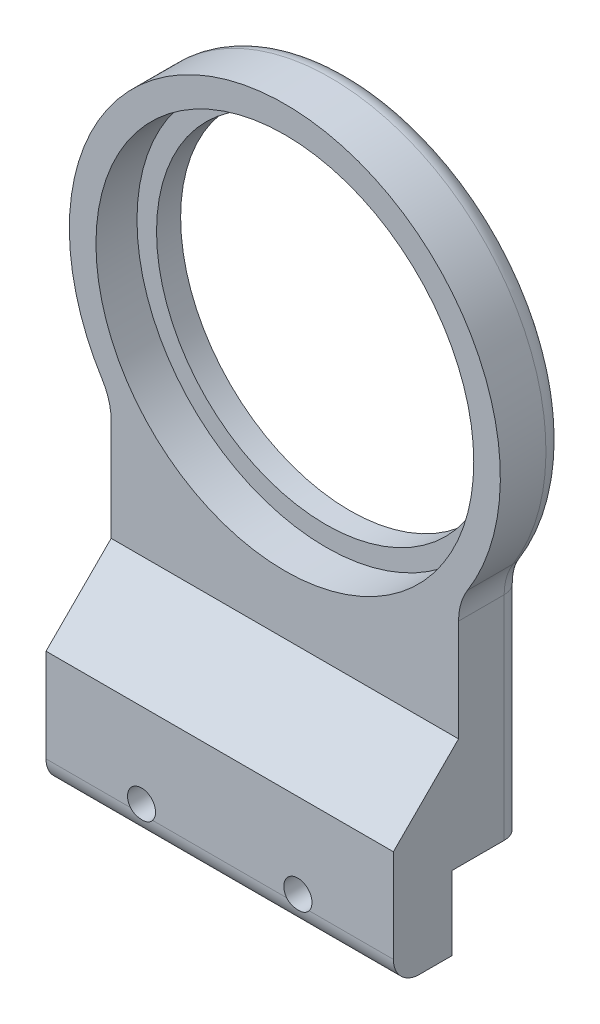
ISO-10303-21;
HEADER;
FILE_DESCRIPTION(('STEP AP214'),'2;1');
FILE_NAME('part.step','',(''),(''),'','','');
FILE_SCHEMA(('AUTOMOTIVE_DESIGN { 1 0 10303 214 1 1 1 1 }'));
ENDSEC;
DATA;
#1=APPLICATION_CONTEXT('core data for automotive mechanical design processes');
#2=APPLICATION_PROTOCOL_DEFINITION('international standard','automotive_design',2000,#1);
#3=PRODUCT_CONTEXT('',#1,'mechanical');
#4=PRODUCT('Part','Part','',(#3));
#5=PRODUCT_RELATED_PRODUCT_CATEGORY('part','',(#4));
#6=PRODUCT_DEFINITION_FORMATION('','',#4);
#7=PRODUCT_DEFINITION_CONTEXT('part definition',#1,'design');
#8=PRODUCT_DEFINITION('design','',#6,#7);
#9=PRODUCT_DEFINITION_SHAPE('','',#8);
#10=(LENGTH_UNIT() NAMED_UNIT(*) SI_UNIT(.MILLI.,.METRE.));
#11=(NAMED_UNIT(*) PLANE_ANGLE_UNIT() SI_UNIT($,.RADIAN.));
#12=(NAMED_UNIT(*) SI_UNIT($,.STERADIAN.) SOLID_ANGLE_UNIT());
#13=UNCERTAINTY_MEASURE_WITH_UNIT(LENGTH_MEASURE(1.E-05),#10,'distance_accuracy_value','');
#14=(GEOMETRIC_REPRESENTATION_CONTEXT(3) GLOBAL_UNCERTAINTY_ASSIGNED_CONTEXT((#13)) GLOBAL_UNIT_ASSIGNED_CONTEXT((#10,
#11,#12)) REPRESENTATION_CONTEXT('',''));
#15=CARTESIAN_POINT('',(0.,0.,0.));
#16=DIRECTION('',(0.,0.,1.));
#17=DIRECTION('',(1.,0.,0.));
#18=AXIS2_PLACEMENT_3D('',#15,#16,#17);
#19=CARTESIAN_POINT('',(-12.,-33.8419962523752,22.));
#20=DIRECTION('',(0.,0.,-1.));
#21=DIRECTION('',(-1.,0.,0.));
#22=AXIS2_PLACEMENT_3D('',#19,#20,#21);
#23=CYLINDRICAL_SURFACE('',#22,1.7);
#24=CARTESIAN_POINT('',(-12.,-33.8419962523752,14.));
#25=DIRECTION('',(0.,0.,1.));
#26=DIRECTION('',(1.,0.,0.));
#27=AXIS2_PLACEMENT_3D('',#24,#25,#26);
#28=CIRCLE('',#27,1.7);
#29=CARTESIAN_POINT('',(-10.3,-33.8419962523752,14.));
#30=VERTEX_POINT('',#29);
#31=EDGE_CURVE('E265',#30,#30,#28,.F.);
#32=ORIENTED_EDGE('',*,*,#31,.F.);
#33=EDGE_LOOP('',(#32));
#34=FACE_BOUND('',#33,.T.);
#35=CARTESIAN_POINT('',(-12.,-33.8419962523752,11.));
#36=DIRECTION('',(0.,0.,-1.));
#37=DIRECTION('',(-1.,0.,0.));
#38=AXIS2_PLACEMENT_3D('',#35,#36,#37);
#39=CIRCLE('',#38,1.7);
#40=CARTESIAN_POINT('',(-13.7,-33.8419962523752,11.));
#41=VERTEX_POINT('',#40);
#42=EDGE_CURVE('E442',#41,#41,#39,.F.);
#43=ORIENTED_EDGE('',*,*,#42,.F.);
#44=EDGE_LOOP('',(#43));
#45=FACE_BOUND('',#44,.T.);
#46=ADVANCED_FACE('F44',(#34,#45),#23,.F.);
#47=CARTESIAN_POINT('',(12.,-33.8419962523752,22.));
#48=DIRECTION('',(0.,0.,-1.));
#49=DIRECTION('',(-1.,0.,0.));
#50=AXIS2_PLACEMENT_3D('',#47,#48,#49);
#51=CYLINDRICAL_SURFACE('',#50,1.7);
#52=CARTESIAN_POINT('',(12.,-33.8419962523752,14.));
#53=DIRECTION('',(0.,0.,1.));
#54=DIRECTION('',(1.,0.,0.));
#55=AXIS2_PLACEMENT_3D('',#52,#53,#54);
#56=CIRCLE('',#55,1.7);
#57=CARTESIAN_POINT('',(13.7,-33.8419962523752,14.));
#58=VERTEX_POINT('',#57);
#59=EDGE_CURVE('E275',#58,#58,#56,.F.);
#60=ORIENTED_EDGE('',*,*,#59,.F.);
#61=EDGE_LOOP('',(#60));
#62=FACE_BOUND('',#61,.T.);
#63=CARTESIAN_POINT('',(12.,-33.8419962523752,11.));
#64=DIRECTION('',(0.,0.,-1.));
#65=DIRECTION('',(-1.,0.,0.));
#66=AXIS2_PLACEMENT_3D('',#63,#64,#65);
#67=CIRCLE('',#66,1.7);
#68=CARTESIAN_POINT('',(10.3,-33.8419962523752,11.));
#69=VERTEX_POINT('',#68);
#70=EDGE_CURVE('E449',#69,#69,#67,.F.);
#71=ORIENTED_EDGE('',*,*,#70,.F.);
#72=EDGE_LOOP('',(#71));
#73=FACE_BOUND('',#72,.T.);
#74=ADVANCED_FACE('F318',(#62,#73),#51,.F.);
#75=CARTESIAN_POINT('',(26.6642218613044,-39.1580037476248,8.));
#76=DIRECTION('',(0.,1.,0.));
#77=DIRECTION('',(0.,0.,1.));
#78=AXIS2_PLACEMENT_3D('',#75,#76,#77);
#79=PLANE('',#78);
#80=DIRECTION('',(0.,0.,1.));
#81=VECTOR('',#80,1.);
#82=CARTESIAN_POINT('',(26.6642218613044,-39.1580037476248,8.));
#83=LINE('',#82,#81);
#84=CARTESIAN_POINT('',(26.6642218613044,-39.1580037476248,11.));
#85=VERTEX_POINT('',#84);
#86=CARTESIAN_POINT('',(26.6642218613044,-39.1580037476248,16.));
#87=VERTEX_POINT('',#86);
#88=EDGE_CURVE('E171',#85,#87,#83,.T.);
#89=ORIENTED_EDGE('',*,*,#88,.T.);
#90=DIRECTION('',(1.,0.,0.));
#91=VECTOR('',#90,1.);
#92=CARTESIAN_POINT('',(-26.6642218613044,-39.1580037476248,16.));
#93=LINE('',#92,#91);
#94=CARTESIAN_POINT('',(-26.6642218613044,-39.1580037476248,16.));
#95=VERTEX_POINT('',#94);
#96=EDGE_CURVE('E53',#87,#95,#93,.F.);
#97=ORIENTED_EDGE('',*,*,#96,.T.);
#98=DIRECTION('',(0.,0.,1.));
#99=VECTOR('',#98,1.);
#100=CARTESIAN_POINT('',(-26.6642218613044,-39.1580037476248,8.));
#101=LINE('',#100,#99);
#102=CARTESIAN_POINT('',(-26.6642218613044,-39.1580037476248,11.));
#103=VERTEX_POINT('',#102);
#104=EDGE_CURVE('E172',#103,#95,#101,.T.);
#105=ORIENTED_EDGE('',*,*,#104,.F.);
#106=DIRECTION('',(-1.,0.,0.));
#107=VECTOR('',#106,1.);
#108=CARTESIAN_POINT('',(26.6642218613044,-39.1580037476248,11.));
#109=LINE('',#108,#107);
#110=EDGE_CURVE('E164',#85,#103,#109,.T.);
#111=ORIENTED_EDGE('',*,*,#110,.F.);
#112=EDGE_LOOP('',(#89,#97,#105,#111));
#113=FACE_BOUND('',#112,.T.);
#114=ADVANCED_FACE('F170',(#113),#79,.F.);
#115=CARTESIAN_POINT('',(26.6642218613044,-27.8419962523752,10.));
#116=DIRECTION('',(0.,1.,0.));
#117=DIRECTION('',(-1.,0.,0.));
#118=AXIS2_PLACEMENT_3D('',#115,#116,#117);
#119=PLANE('',#118);
#120=DIRECTION('',(0.,0.,-1.));
#121=VECTOR('',#120,1.);
#122=CARTESIAN_POINT('',(-26.6642218613044,-27.8419962523752,10.));
#123=LINE('',#122,#121);
#124=CARTESIAN_POINT('',(-26.6642218613044,-27.8419962523752,11.));
#125=VERTEX_POINT('',#124);
#126=CARTESIAN_POINT('',(-26.6642218613044,-27.8419962523752,3.));
#127=VERTEX_POINT('',#126);
#128=EDGE_CURVE('E205',#125,#127,#123,.T.);
#129=ORIENTED_EDGE('',*,*,#128,.T.);
#130=CARTESIAN_POINT('',(-23.6642218613044,-27.8419962523752,3.));
#131=DIRECTION('',(0.,1.,0.));
#132=DIRECTION('',(-1.,0.,0.));
#133=AXIS2_PLACEMENT_3D('',#130,#131,#132);
#134=CIRCLE('',#133,3.);
#135=CARTESIAN_POINT('',(-23.6642218613044,-27.8419962523752,0.));
#136=VERTEX_POINT('',#135);
#137=EDGE_CURVE('E240',#127,#136,#134,.F.);
#138=ORIENTED_EDGE('',*,*,#137,.T.);
#139=DIRECTION('',(1.,0.,0.));
#140=VECTOR('',#139,1.);
#141=CARTESIAN_POINT('',(26.6642218613044,-27.8419962523752,0.));
#142=LINE('',#141,#140);
#143=CARTESIAN_POINT('',(23.6642218613044,-27.8419962523752,0.));
#144=VERTEX_POINT('',#143);
#145=EDGE_CURVE('E191',#136,#144,#142,.T.);
#146=ORIENTED_EDGE('',*,*,#145,.T.);
#147=CARTESIAN_POINT('',(23.6642218613044,-27.8419962523752,3.));
#148=DIRECTION('',(0.,1.,0.));
#149=DIRECTION('',(-1.,0.,0.));
#150=AXIS2_PLACEMENT_3D('',#147,#148,#149);
#151=CIRCLE('',#150,3.);
#152=CARTESIAN_POINT('',(26.6642218613044,-27.8419962523752,3.));
#153=VERTEX_POINT('',#152);
#154=EDGE_CURVE('E238',#144,#153,#151,.F.);
#155=ORIENTED_EDGE('',*,*,#154,.T.);
#156=DIRECTION('',(0.,0.,-1.));
#157=VECTOR('',#156,1.);
#158=CARTESIAN_POINT('',(26.6642218613044,-27.8419962523752,10.));
#159=LINE('',#158,#157);
#160=CARTESIAN_POINT('',(26.6642218613044,-27.8419962523752,11.));
#161=VERTEX_POINT('',#160);
#162=EDGE_CURVE('E201',#161,#153,#159,.T.);
#163=ORIENTED_EDGE('',*,*,#162,.F.);
#164=DIRECTION('',(1.,0.,0.));
#165=VECTOR('',#164,1.);
#166=CARTESIAN_POINT('',(26.6642218613044,-27.8419962523752,11.));
#167=LINE('',#166,#165);
#168=EDGE_CURVE('E167',#125,#161,#167,.T.);
#169=ORIENTED_EDGE('',*,*,#168,.F.);
#170=EDGE_LOOP('',(#129,#138,#146,#155,#163,#169));
#171=FACE_BOUND('',#170,.T.);
#172=ADVANCED_FACE('F333',(#171),#119,.F.);
#173=CARTESIAN_POINT('',(0.,27.1580037476248,10.));
#174=DIRECTION('',(0.,0.,-1.));
#175=DIRECTION('',(-1.,0.,0.));
#176=AXIS2_PLACEMENT_3D('',#173,#174,#175);
#177=CYLINDRICAL_SURFACE('',#176,26.);
#178=CARTESIAN_POINT('',(0.,27.1580037476248,0.));
#179=DIRECTION('',(0.,0.,1.));
#180=DIRECTION('',(1.,0.,0.));
#181=AXIS2_PLACEMENT_3D('',#178,#179,#180);
#182=CIRCLE('',#181,26.);
#183=CARTESIAN_POINT('',(26.,27.1580037476248,0.));
#184=VERTEX_POINT('',#183);
#185=EDGE_CURVE('E188',#184,#184,#182,.T.);
#186=ORIENTED_EDGE('',*,*,#185,.F.);
#187=EDGE_LOOP('',(#186));
#188=FACE_BOUND('',#187,.T.);
#189=CARTESIAN_POINT('',(0.,27.1580037476248,3.7));
#190=DIRECTION('',(0.,0.,1.));
#191=DIRECTION('',(1.,0.,0.));
#192=AXIS2_PLACEMENT_3D('',#189,#190,#191);
#193=CIRCLE('',#192,26.);
#194=CARTESIAN_POINT('',(26.,27.1580037476248,3.7));
#195=VERTEX_POINT('',#194);
#196=EDGE_CURVE('E186',#195,#195,#193,.T.);
#197=ORIENTED_EDGE('',*,*,#196,.T.);
#198=EDGE_LOOP('',(#197));
#199=FACE_BOUND('',#198,.T.);
#200=ADVANCED_FACE('F344',(#188,#199),#177,.F.);
#201=CARTESIAN_POINT('',(0.,27.1580037476248,10.));
#202=DIRECTION('',(0.,0.,1.));
#203=DIRECTION('',(1.,0.,0.));
#204=AXIS2_PLACEMENT_3D('',#201,#202,#203);
#205=PLANE('',#204);
#206=DIRECTION('',(0.,-1.,0.));
#207=VECTOR('',#206,1.);
#208=CARTESIAN_POINT('',(-26.6642218613044,-27.8419962523752,10.));
#209=LINE('',#208,#207);
#210=CARTESIAN_POINT('',(-26.6642218613044,4.81802414763173,10.));
#211=VERTEX_POINT('',#210);
#212=CARTESIAN_POINT('',(-26.6642218613044,-10.8419962523751,10.));
#213=VERTEX_POINT('',#212);
#214=EDGE_CURVE('E198',#211,#213,#209,.T.);
#215=ORIENTED_EDGE('',*,*,#214,.T.);
#216=DIRECTION('',(1.,0.,0.));
#217=VECTOR('',#216,1.);
#218=CARTESIAN_POINT('',(26.6642218613044,-10.8419962523751,10.));
#219=LINE('',#218,#217);
#220=CARTESIAN_POINT('',(26.6642218613044,-10.8419962523751,10.));
#221=VERTEX_POINT('',#220);
#222=EDGE_CURVE('E224',#213,#221,#219,.T.);
#223=ORIENTED_EDGE('',*,*,#222,.T.);
#224=DIRECTION('',(0.,1.,0.));
#225=VECTOR('',#224,1.);
#226=CARTESIAN_POINT('',(26.6642218613044,-27.8419962523752,10.));
#227=LINE('',#226,#225);
#228=CARTESIAN_POINT('',(26.6642218613044,4.81802414763171,10.));
#229=VERTEX_POINT('',#228);
#230=EDGE_CURVE('E192',#221,#229,#227,.T.);
#231=ORIENTED_EDGE('',*,*,#230,.T.);
#232=CARTESIAN_POINT('',(35.6642218613044,4.81802414763172,10.));
#233=DIRECTION('',(0.,0.,1.));
#234=DIRECTION('',(1.,0.,0.));
#235=AXIS2_PLACEMENT_3D('',#232,#233,#234);
#236=CIRCLE('',#235,9.);
#237=CARTESIAN_POINT('',(28.0370315533064,9.59567712849809,10.));
#238=VERTEX_POINT('',#237);
#239=EDGE_CURVE('E222',#229,#238,#236,.F.);
#240=ORIENTED_EDGE('',*,*,#239,.T.);
#241=CARTESIAN_POINT('',(0.,27.1580037476248,10.));
#242=DIRECTION('',(0.,0.,1.));
#243=DIRECTION('',(1.,0.,0.));
#244=AXIS2_PLACEMENT_3D('',#241,#242,#243);
#245=CIRCLE('',#244,33.0833863834703);
#246=CARTESIAN_POINT('',(-28.0370315533064,9.5956771284981,10.));
#247=VERTEX_POINT('',#246);
#248=EDGE_CURVE('E195',#238,#247,#245,.T.);
#249=ORIENTED_EDGE('',*,*,#248,.T.);
#250=CARTESIAN_POINT('',(-35.6642218613044,4.81802414763172,10.));
#251=DIRECTION('',(0.,0.,1.));
#252=DIRECTION('',(1.,0.,0.));
#253=AXIS2_PLACEMENT_3D('',#250,#251,#252);
#254=CIRCLE('',#253,9.);
#255=EDGE_CURVE('E220',#247,#211,#254,.F.);
#256=ORIENTED_EDGE('',*,*,#255,.T.);
#257=EDGE_LOOP('',(#215,#223,#231,#240,#249,#256));
#258=FACE_BOUND('',#257,.T.);
#259=CARTESIAN_POINT('',(0.,27.1580037476248,10.));
#260=DIRECTION('',(0.,0.,1.));
#261=DIRECTION('',(1.,0.,0.));
#262=AXIS2_PLACEMENT_3D('',#259,#260,#261);
#263=CIRCLE('',#262,29.);
#264=CARTESIAN_POINT('',(29.,27.1580037476248,10.));
#265=VERTEX_POINT('',#264);
#266=EDGE_CURVE('E176',#265,#265,#263,.T.);
#267=ORIENTED_EDGE('',*,*,#266,.F.);
#268=EDGE_LOOP('',(#267));
#269=FACE_BOUND('',#268,.T.);
#270=ADVANCED_FACE('F347',(#258,#269),#205,.T.);
#271=CARTESIAN_POINT('',(0.,27.1580037476248,0.));
#272=DIRECTION('',(0.,0.,1.));
#273=DIRECTION('',(1.,0.,0.));
#274=AXIS2_PLACEMENT_3D('',#271,#272,#273);
#275=PLANE('',#274);
#276=ORIENTED_EDGE('',*,*,#145,.F.);
#277=DIRECTION('',(0.,-1.,0.));
#278=VECTOR('',#277,1.);
#279=CARTESIAN_POINT('',(-23.6642218613044,27.1580037476248,0.));
#280=LINE('',#279,#278);
#281=CARTESIAN_POINT('',(-23.6642218613044,4.81802414763172,0.));
#282=VERTEX_POINT('',#281);
#283=EDGE_CURVE('E250',#136,#282,#280,.F.);
#284=ORIENTED_EDGE('',*,*,#283,.T.);
#285=CARTESIAN_POINT('',(-35.6642218613044,4.81802414763172,0.));
#286=DIRECTION('',(0.,0.,1.));
#287=DIRECTION('',(1.,0.,0.));
#288=AXIS2_PLACEMENT_3D('',#285,#286,#287);
#289=CIRCLE('',#288,12.);
#290=CARTESIAN_POINT('',(-25.4946347839737,11.1882281221202,0.));
#291=VERTEX_POINT('',#290);
#292=EDGE_CURVE('E248',#282,#291,#289,.T.);
#293=ORIENTED_EDGE('',*,*,#292,.T.);
#294=CARTESIAN_POINT('',(0.,27.1580037476248,0.));
#295=DIRECTION('',(0.,0.,1.));
#296=DIRECTION('',(1.,0.,0.));
#297=AXIS2_PLACEMENT_3D('',#294,#295,#296);
#298=CIRCLE('',#297,30.0833863834703);
#299=CARTESIAN_POINT('',(25.4946347839737,11.1882281221202,0.));
#300=VERTEX_POINT('',#299);
#301=EDGE_CURVE('E242',#291,#300,#298,.F.);
#302=ORIENTED_EDGE('',*,*,#301,.T.);
#303=CARTESIAN_POINT('',(35.6642218613044,4.81802414763172,0.));
#304=DIRECTION('',(0.,0.,1.));
#305=DIRECTION('',(1.,0.,0.));
#306=AXIS2_PLACEMENT_3D('',#303,#304,#305);
#307=CIRCLE('',#306,12.);
#308=CARTESIAN_POINT('',(23.6642218613044,4.81802414763171,0.));
#309=VERTEX_POINT('',#308);
#310=EDGE_CURVE('E244',#300,#309,#307,.T.);
#311=ORIENTED_EDGE('',*,*,#310,.T.);
#312=DIRECTION('',(0.,1.,0.));
#313=VECTOR('',#312,1.);
#314=CARTESIAN_POINT('',(23.6642218613044,27.1580037476248,0.));
#315=LINE('',#314,#313);
#316=EDGE_CURVE('E246',#309,#144,#315,.F.);
#317=ORIENTED_EDGE('',*,*,#316,.T.);
#318=EDGE_LOOP('',(#276,#284,#293,#302,#311,#317));
#319=FACE_BOUND('',#318,.T.);
#320=ORIENTED_EDGE('',*,*,#185,.T.);
#321=EDGE_LOOP('',(#320));
#322=FACE_BOUND('',#321,.T.);
#323=ADVANCED_FACE('F351',(#319,#322),#275,.F.);
#324=CARTESIAN_POINT('',(26.6642218613044,-27.8419962523752,10.));
#325=DIRECTION('',(-1.,0.,0.));
#326=DIRECTION('',(0.,-1.,0.));
#327=AXIS2_PLACEMENT_3D('',#324,#325,#326);
#328=PLANE('',#327);
#329=DIRECTION('',(0.,1.,0.));
#330=VECTOR('',#329,1.);
#331=CARTESIAN_POINT('',(26.6642218613044,-27.8419962523752,20.));
#332=LINE('',#331,#330);
#333=CARTESIAN_POINT('',(26.6642218613044,-35.1580037476248,20.));
#334=VERTEX_POINT('',#333);
#335=CARTESIAN_POINT('',(26.6642218613044,-20.841996252375,20.));
#336=VERTEX_POINT('',#335);
#337=EDGE_CURVE('E181',#334,#336,#332,.T.);
#338=ORIENTED_EDGE('',*,*,#337,.F.);
#339=CARTESIAN_POINT('',(26.6642218613044,-35.1580037476248,16.));
#340=DIRECTION('',(-1.,0.,0.));
#341=DIRECTION('',(0.,-1.,0.));
#342=AXIS2_PLACEMENT_3D('',#339,#340,#341);
#343=CIRCLE('',#342,4.);
#344=EDGE_CURVE('E67',#334,#87,#343,.F.);
#345=ORIENTED_EDGE('',*,*,#344,.T.);
#346=ORIENTED_EDGE('',*,*,#88,.F.);
#347=DIRECTION('',(0.,-1.,0.));
#348=VECTOR('',#347,1.);
#349=CARTESIAN_POINT('',(26.6642218613044,-27.8419962523752,11.));
#350=LINE('',#349,#348);
#351=EDGE_CURVE('E159',#161,#85,#350,.T.);
#352=ORIENTED_EDGE('',*,*,#351,.F.);
#353=ORIENTED_EDGE('',*,*,#162,.T.);
#354=DIRECTION('',(0.,1.,0.));
#355=VECTOR('',#354,1.);
#356=CARTESIAN_POINT('',(26.6642218613044,-27.8419962523752,3.));
#357=LINE('',#356,#355);
#358=CARTESIAN_POINT('',(26.6642218613044,4.81802414763171,3.));
#359=VERTEX_POINT('',#358);
#360=EDGE_CURVE('E254',#153,#359,#357,.T.);
#361=ORIENTED_EDGE('',*,*,#360,.T.);
#362=DIRECTION('',(0.,0.,1.));
#363=VECTOR('',#362,1.);
#364=CARTESIAN_POINT('',(26.6642218613044,4.81802414763171,10.));
#365=LINE('',#364,#363);
#366=EDGE_CURVE('E218',#359,#229,#365,.T.);
#367=ORIENTED_EDGE('',*,*,#366,.T.);
#368=ORIENTED_EDGE('',*,*,#230,.F.);
#369=DIRECTION('',(0.,0.707106781186544,-0.707106781186551));
#370=VECTOR('',#369,1.);
#371=CARTESIAN_POINT('',(26.6642218613044,-19.341996252375,18.5));
#372=LINE('',#371,#370);
#373=EDGE_CURVE('E232',#221,#336,#372,.F.);
#374=ORIENTED_EDGE('',*,*,#373,.T.);
#375=EDGE_LOOP('',(#338,#345,#346,#352,#353,#361,#367,#368,#374));
#376=FACE_BOUND('',#375,.T.);
#377=ADVANCED_FACE('F175',(#376),#328,.F.);
#378=CARTESIAN_POINT('',(0.,27.1580037476248,10.));
#379=DIRECTION('',(0.,0.,-1.));
#380=DIRECTION('',(-1.,0.,0.));
#381=AXIS2_PLACEMENT_3D('',#378,#379,#380);
#382=CYLINDRICAL_SURFACE('',#381,33.0833863834703);
#383=DIRECTION('',(0.,0.,-1.));
#384=VECTOR('',#383,1.);
#385=CARTESIAN_POINT('',(28.0370315533064,9.59567712849809,10.));
#386=LINE('',#385,#384);
#387=CARTESIAN_POINT('',(28.0370315533064,9.59567712849809,3.));
#388=VERTEX_POINT('',#387);
#389=EDGE_CURVE('E213',#238,#388,#386,.T.);
#390=ORIENTED_EDGE('',*,*,#389,.T.);
#391=CARTESIAN_POINT('',(0.,27.1580037476248,3.));
#392=DIRECTION('',(0.,0.,1.));
#393=DIRECTION('',(1.,0.,0.));
#394=AXIS2_PLACEMENT_3D('',#391,#392,#393);
#395=CIRCLE('',#394,33.0833863834703);
#396=CARTESIAN_POINT('',(-28.0370315533064,9.59567712849809,3.));
#397=VERTEX_POINT('',#396);
#398=EDGE_CURVE('E258',#388,#397,#395,.T.);
#399=ORIENTED_EDGE('',*,*,#398,.T.);
#400=DIRECTION('',(0.,0.,-1.));
#401=VECTOR('',#400,1.);
#402=CARTESIAN_POINT('',(-28.0370315533064,9.59567712849809,10.));
#403=LINE('',#402,#401);
#404=EDGE_CURVE('E216',#397,#247,#403,.F.);
#405=ORIENTED_EDGE('',*,*,#404,.T.);
#406=ORIENTED_EDGE('',*,*,#248,.F.);
#407=EDGE_LOOP('',(#390,#399,#405,#406));
#408=FACE_BOUND('',#407,.T.);
#409=ADVANCED_FACE('F361',(#408),#382,.T.);
#410=CARTESIAN_POINT('',(-26.6642218613044,-27.8419962523752,10.));
#411=DIRECTION('',(1.,0.,0.));
#412=DIRECTION('',(0.,1.,0.));
#413=AXIS2_PLACEMENT_3D('',#410,#411,#412);
#414=PLANE('',#413);
#415=ORIENTED_EDGE('',*,*,#104,.T.);
#416=CARTESIAN_POINT('',(-26.6642218613044,-35.1580037476248,16.));
#417=DIRECTION('',(1.,0.,0.));
#418=DIRECTION('',(0.,1.,0.));
#419=AXIS2_PLACEMENT_3D('',#416,#417,#418);
#420=CIRCLE('',#419,4.);
#421=CARTESIAN_POINT('',(-26.6642218613044,-35.1580037476248,20.));
#422=VERTEX_POINT('',#421);
#423=EDGE_CURVE('E11',#95,#422,#420,.F.);
#424=ORIENTED_EDGE('',*,*,#423,.T.);
#425=DIRECTION('',(0.,-1.,0.));
#426=VECTOR('',#425,1.);
#427=CARTESIAN_POINT('',(-26.6642218613044,-27.8419962523752,20.));
#428=LINE('',#427,#426);
#429=CARTESIAN_POINT('',(-26.6642218613044,-20.841996252375,20.));
#430=VERTEX_POINT('',#429);
#431=EDGE_CURVE('E274',#430,#422,#428,.T.);
#432=ORIENTED_EDGE('',*,*,#431,.F.);
#433=DIRECTION('',(0.,-0.707106781186544,0.707106781186551));
#434=VECTOR('',#433,1.);
#435=CARTESIAN_POINT('',(-26.6642218613044,-19.341996252375,18.5));
#436=LINE('',#435,#434);
#437=EDGE_CURVE('E230',#430,#213,#436,.F.);
#438=ORIENTED_EDGE('',*,*,#437,.T.);
#439=ORIENTED_EDGE('',*,*,#214,.F.);
#440=DIRECTION('',(0.,0.,1.));
#441=VECTOR('',#440,1.);
#442=CARTESIAN_POINT('',(-26.6642218613044,4.81802414763172,0.));
#443=LINE('',#442,#441);
#444=CARTESIAN_POINT('',(-26.6642218613044,4.81802414763172,3.));
#445=VERTEX_POINT('',#444);
#446=EDGE_CURVE('E208',#211,#445,#443,.F.);
#447=ORIENTED_EDGE('',*,*,#446,.T.);
#448=DIRECTION('',(0.,-1.,0.));
#449=VECTOR('',#448,1.);
#450=CARTESIAN_POINT('',(-26.6642218613044,-27.8419962523752,3.));
#451=LINE('',#450,#449);
#452=EDGE_CURVE('E235',#445,#127,#451,.T.);
#453=ORIENTED_EDGE('',*,*,#452,.T.);
#454=ORIENTED_EDGE('',*,*,#128,.F.);
#455=DIRECTION('',(0.,1.,0.));
#456=VECTOR('',#455,1.);
#457=CARTESIAN_POINT('',(-26.6642218613044,-27.8419962523752,11.));
#458=LINE('',#457,#456);
#459=EDGE_CURVE('E173',#103,#125,#458,.T.);
#460=ORIENTED_EDGE('',*,*,#459,.F.);
#461=EDGE_LOOP('',(#415,#424,#432,#438,#439,#447,#453,#454,#460));
#462=FACE_BOUND('',#461,.T.);
#463=ADVANCED_FACE('F342',(#462),#414,.F.);
#464=CARTESIAN_POINT('',(0.,27.1580037476248,3.7));
#465=DIRECTION('',(0.,0.,1.));
#466=DIRECTION('',(1.,0.,0.));
#467=AXIS2_PLACEMENT_3D('',#464,#465,#466);
#468=CYLINDRICAL_SURFACE('',#467,29.);
#469=CARTESIAN_POINT('',(0.,27.1580037476248,3.7));
#470=DIRECTION('',(0.,0.,1.));
#471=DIRECTION('',(1.,0.,0.));
#472=AXIS2_PLACEMENT_3D('',#469,#470,#471);
#473=CIRCLE('',#472,29.);
#474=CARTESIAN_POINT('',(29.,27.1580037476248,3.7));
#475=VERTEX_POINT('',#474);
#476=EDGE_CURVE('E179',#475,#475,#473,.T.);
#477=ORIENTED_EDGE('',*,*,#476,.F.);
#478=EDGE_LOOP('',(#477));
#479=FACE_BOUND('',#478,.T.);
#480=ORIENTED_EDGE('',*,*,#266,.T.);
#481=EDGE_LOOP('',(#480));
#482=FACE_BOUND('',#481,.T.);
#483=ADVANCED_FACE('F338',(#479,#482),#468,.F.);
#484=CARTESIAN_POINT('',(0.,27.1580037476248,3.7));
#485=DIRECTION('',(0.,0.,1.));
#486=DIRECTION('',(1.,0.,0.));
#487=AXIS2_PLACEMENT_3D('',#484,#485,#486);
#488=PLANE('',#487);
#489=ORIENTED_EDGE('',*,*,#196,.F.);
#490=EDGE_LOOP('',(#489));
#491=FACE_BOUND('',#490,.T.);
#492=ORIENTED_EDGE('',*,*,#476,.T.);
#493=EDGE_LOOP('',(#492));
#494=FACE_BOUND('',#493,.T.);
#495=ADVANCED_FACE('F334',(#491,#494),#488,.T.);
#496=CARTESIAN_POINT('',(-35.6642218613044,4.81802414763172,10.));
#497=DIRECTION('',(0.,0.,-1.));
#498=DIRECTION('',(-1.,0.,0.));
#499=AXIS2_PLACEMENT_3D('',#496,#497,#498);
#500=CYLINDRICAL_SURFACE('',#499,9.);
#501=ORIENTED_EDGE('',*,*,#404,.F.);
#502=CARTESIAN_POINT('',(-35.6642218613044,4.81802414763172,3.));
#503=DIRECTION('',(0.,0.,1.));
#504=DIRECTION('',(1.,0.,0.));
#505=AXIS2_PLACEMENT_3D('',#502,#503,#504);
#506=CIRCLE('',#505,9.);
#507=EDGE_CURVE('E252',#397,#445,#506,.F.);
#508=ORIENTED_EDGE('',*,*,#507,.T.);
#509=ORIENTED_EDGE('',*,*,#446,.F.);
#510=ORIENTED_EDGE('',*,*,#255,.F.);
#511=EDGE_LOOP('',(#501,#508,#509,#510));
#512=FACE_BOUND('',#511,.T.);
#513=ADVANCED_FACE('F337',(#512),#500,.F.);
#514=CARTESIAN_POINT('',(35.6642218613044,4.81802414763172,10.));
#515=DIRECTION('',(0.,0.,-1.));
#516=DIRECTION('',(-1.,0.,0.));
#517=AXIS2_PLACEMENT_3D('',#514,#515,#516);
#518=CYLINDRICAL_SURFACE('',#517,9.);
#519=ORIENTED_EDGE('',*,*,#366,.F.);
#520=CARTESIAN_POINT('',(35.6642218613044,4.81802414763172,3.));
#521=DIRECTION('',(0.,0.,1.));
#522=DIRECTION('',(1.,0.,0.));
#523=AXIS2_PLACEMENT_3D('',#520,#521,#522);
#524=CIRCLE('',#523,9.);
#525=EDGE_CURVE('E256',#359,#388,#524,.F.);
#526=ORIENTED_EDGE('',*,*,#525,.T.);
#527=ORIENTED_EDGE('',*,*,#389,.F.);
#528=ORIENTED_EDGE('',*,*,#239,.F.);
#529=EDGE_LOOP('',(#519,#526,#527,#528));
#530=FACE_BOUND('',#529,.T.);
#531=ADVANCED_FACE('F329',(#530),#518,.F.);
#532=CARTESIAN_POINT('',(0.,0.,20.));
#533=DIRECTION('',(0.,0.,1.));
#534=DIRECTION('',(1.,0.,0.));
#535=AXIS2_PLACEMENT_3D('',#532,#533,#534);
#536=PLANE('',#535);
#537=ORIENTED_EDGE('',*,*,#431,.T.);
#538=DIRECTION('',(1.,0.,0.));
#539=VECTOR('',#538,1.);
#540=CARTESIAN_POINT('',(26.6642218613044,-35.1580037476248,20.));
#541=LINE('',#540,#539);
#542=CARTESIAN_POINT('',(-13.7001835996286,-35.1580037476248,20.));
#543=VERTEX_POINT('',#542);
#544=EDGE_CURVE('E284',#422,#543,#541,.T.);
#545=ORIENTED_EDGE('',*,*,#544,.T.);
#546=CARTESIAN_POINT('',(-12.,-33.8419962523749,20.));
#547=DIRECTION('',(0.,0.,1.));
#548=DIRECTION('',(1.,0.,0.));
#549=AXIS2_PLACEMENT_3D('',#546,#547,#548);
#550=CIRCLE('',#549,2.15);
#551=CARTESIAN_POINT('',(-10.2998164003714,-35.1580037476248,20.));
#552=VERTEX_POINT('',#551);
#553=EDGE_CURVE('E436',#552,#543,#550,.T.);
#554=ORIENTED_EDGE('',*,*,#553,.F.);
#555=DIRECTION('',(1.,0.,0.));
#556=VECTOR('',#555,1.);
#557=CARTESIAN_POINT('',(26.6642218613044,-35.1580037476248,20.));
#558=LINE('',#557,#556);
#559=CARTESIAN_POINT('',(10.2808870681523,-35.1580037476248,20.));
#560=VERTEX_POINT('',#559);
#561=EDGE_CURVE('E282',#552,#560,#558,.T.);
#562=ORIENTED_EDGE('',*,*,#561,.T.);
#563=CARTESIAN_POINT('',(12.,-33.8419962523749,20.));
#564=DIRECTION('',(0.,0.,1.));
#565=DIRECTION('',(1.,0.,0.));
#566=AXIS2_PLACEMENT_3D('',#563,#564,#565);
#567=CIRCLE('',#566,2.165);
#568=CARTESIAN_POINT('',(13.7191129318477,-35.1580037476248,20.));
#569=VERTEX_POINT('',#568);
#570=EDGE_CURVE('E433',#569,#560,#567,.T.);
#571=ORIENTED_EDGE('',*,*,#570,.F.);
#572=DIRECTION('',(1.,0.,0.));
#573=VECTOR('',#572,1.);
#574=CARTESIAN_POINT('',(26.6642218613044,-35.1580037476248,20.));
#575=LINE('',#574,#573);
#576=EDGE_CURVE('E260',#569,#334,#575,.T.);
#577=ORIENTED_EDGE('',*,*,#576,.T.);
#578=ORIENTED_EDGE('',*,*,#337,.T.);
#579=DIRECTION('',(1.,0.,0.));
#580=VECTOR('',#579,1.);
#581=CARTESIAN_POINT('',(0.,-20.841996252375,20.));
#582=LINE('',#581,#580);
#583=EDGE_CURVE('E227',#336,#430,#582,.F.);
#584=ORIENTED_EDGE('',*,*,#583,.T.);
#585=EDGE_LOOP('',(#537,#545,#554,#562,#571,#577,#578,#584));
#586=FACE_BOUND('',#585,.T.);
#587=ADVANCED_FACE('F325',(#586),#536,.T.);
#588=CARTESIAN_POINT('',(0.,-24.8419962523752,24.0000000000002));
#589=DIRECTION('',(0.,0.707106781186551,0.707106781186544));
#590=DIRECTION('',(1.,0.,0.));
#591=AXIS2_PLACEMENT_3D('',#588,#589,#590);
#592=PLANE('',#591);
#593=ORIENTED_EDGE('',*,*,#373,.F.);
#594=ORIENTED_EDGE('',*,*,#222,.F.);
#595=ORIENTED_EDGE('',*,*,#437,.F.);
#596=ORIENTED_EDGE('',*,*,#583,.F.);
#597=EDGE_LOOP('',(#593,#594,#595,#596));
#598=FACE_BOUND('',#597,.T.);
#599=ADVANCED_FACE('F328',(#598),#592,.T.);
#600=CARTESIAN_POINT('',(23.6642218613044,-27.8419962523752,3.));
#601=DIRECTION('',(0.,1.,0.));
#602=DIRECTION('',(-1.,0.,0.));
#603=AXIS2_PLACEMENT_3D('',#600,#601,#602);
#604=CYLINDRICAL_SURFACE('',#603,3.);
#605=ORIENTED_EDGE('',*,*,#154,.F.);
#606=ORIENTED_EDGE('',*,*,#316,.F.);
#607=CARTESIAN_POINT('',(23.6642218613044,4.81802414763171,3.));
#608=DIRECTION('',(0.,1.,0.));
#609=DIRECTION('',(-1.,0.,0.));
#610=AXIS2_PLACEMENT_3D('',#607,#608,#609);
#611=CIRCLE('',#610,3.);
#612=EDGE_CURVE('E271',#359,#309,#611,.T.);
#613=ORIENTED_EDGE('',*,*,#612,.F.);
#614=ORIENTED_EDGE('',*,*,#360,.F.);
#615=EDGE_LOOP('',(#605,#606,#613,#614));
#616=FACE_BOUND('',#615,.T.);
#617=ADVANCED_FACE('F379',(#616),#604,.T.);
#618=CARTESIAN_POINT('',(35.6642218613044,4.81802414763172,3.));
#619=DIRECTION('',(0.,0.,1.));
#620=DIRECTION('',(1.,0.,0.));
#621=AXIS2_PLACEMENT_3D('',#618,#619,#620);
#622=TOROIDAL_SURFACE('',#621,12.,3.);
#623=ORIENTED_EDGE('',*,*,#612,.T.);
#624=ORIENTED_EDGE('',*,*,#310,.F.);
#625=CARTESIAN_POINT('',(25.4946347839737,11.1882281221202,3.));
#626=DIRECTION('',(0.530850331207375,0.847465589777556,0.));
#627=DIRECTION('',(-0.847465589777556,0.530850331207375,0.));
#628=AXIS2_PLACEMENT_3D('',#625,#626,#627);
#629=CIRCLE('',#628,3.);
#630=EDGE_CURVE('E268',#388,#300,#629,.T.);
#631=ORIENTED_EDGE('',*,*,#630,.F.);
#632=ORIENTED_EDGE('',*,*,#525,.F.);
#633=EDGE_LOOP('',(#623,#624,#631,#632));
#634=FACE_BOUND('',#633,.T.);
#635=ADVANCED_FACE('F391',(#634),#622,.T.);
#636=CARTESIAN_POINT('',(0.,27.1580037476248,3.));
#637=DIRECTION('',(0.,0.,1.));
#638=DIRECTION('',(1.,0.,0.));
#639=AXIS2_PLACEMENT_3D('',#636,#637,#638);
#640=TOROIDAL_SURFACE('',#639,30.0833863834703,3.);
#641=ORIENTED_EDGE('',*,*,#630,.T.);
#642=ORIENTED_EDGE('',*,*,#301,.F.);
#643=CARTESIAN_POINT('',(-25.4946347839737,11.1882281221202,3.));
#644=DIRECTION('',(0.530850331207374,-0.847465589777556,0.));
#645=DIRECTION('',(0.847465589777556,0.530850331207374,0.));
#646=AXIS2_PLACEMENT_3D('',#643,#644,#645);
#647=CIRCLE('',#646,3.);
#648=EDGE_CURVE('E264',#397,#291,#647,.T.);
#649=ORIENTED_EDGE('',*,*,#648,.F.);
#650=ORIENTED_EDGE('',*,*,#398,.F.);
#651=EDGE_LOOP('',(#641,#642,#649,#650));
#652=FACE_BOUND('',#651,.T.);
#653=ADVANCED_FACE('F387',(#652),#640,.T.);
#654=CARTESIAN_POINT('',(-35.6642218613044,4.81802414763172,3.));
#655=DIRECTION('',(0.,0.,1.));
#656=DIRECTION('',(1.,0.,0.));
#657=AXIS2_PLACEMENT_3D('',#654,#655,#656);
#658=TOROIDAL_SURFACE('',#657,12.,3.);
#659=ORIENTED_EDGE('',*,*,#648,.T.);
#660=ORIENTED_EDGE('',*,*,#292,.F.);
#661=CARTESIAN_POINT('',(-23.6642218613044,4.81802414763172,3.));
#662=DIRECTION('',(0.,-1.,0.));
#663=DIRECTION('',(0.,0.,-1.));
#664=AXIS2_PLACEMENT_3D('',#661,#662,#663);
#665=CIRCLE('',#664,3.);
#666=EDGE_CURVE('E261',#445,#282,#665,.T.);
#667=ORIENTED_EDGE('',*,*,#666,.F.);
#668=ORIENTED_EDGE('',*,*,#507,.F.);
#669=EDGE_LOOP('',(#659,#660,#667,#668));
#670=FACE_BOUND('',#669,.T.);
#671=ADVANCED_FACE('F383',(#670),#658,.T.);
#672=CARTESIAN_POINT('',(-23.6642218613044,-27.8419962523752,3.));
#673=DIRECTION('',(0.,-1.,0.));
#674=DIRECTION('',(1.,0.,0.));
#675=AXIS2_PLACEMENT_3D('',#672,#673,#674);
#676=CYLINDRICAL_SURFACE('',#675,3.);
#677=ORIENTED_EDGE('',*,*,#666,.T.);
#678=ORIENTED_EDGE('',*,*,#283,.F.);
#679=ORIENTED_EDGE('',*,*,#137,.F.);
#680=ORIENTED_EDGE('',*,*,#452,.F.);
#681=EDGE_LOOP('',(#677,#678,#679,#680));
#682=FACE_BOUND('',#681,.T.);
#683=ADVANCED_FACE('F316',(#682),#676,.T.);
#684=CARTESIAN_POINT('',(12.,-33.8419962523749,14.));
#685=DIRECTION('',(0.,0.,1.));
#686=DIRECTION('',(1.,0.,0.));
#687=AXIS2_PLACEMENT_3D('',#684,#685,#686);
#688=PLANE('',#687);
#689=CARTESIAN_POINT('',(12.,-33.8419962523749,14.));
#690=DIRECTION('',(0.,0.,1.));
#691=DIRECTION('',(1.,0.,0.));
#692=AXIS2_PLACEMENT_3D('',#689,#690,#691);
#693=CIRCLE('',#692,2.165);
#694=CARTESIAN_POINT('',(14.165,-33.8419962523749,14.));
#695=VERTEX_POINT('',#694);
#696=EDGE_CURVE('E437',#695,#695,#693,.T.);
#697=ORIENTED_EDGE('',*,*,#696,.T.);
#698=EDGE_LOOP('',(#697));
#699=FACE_BOUND('',#698,.T.);
#700=ORIENTED_EDGE('',*,*,#59,.T.);
#701=EDGE_LOOP('',(#700));
#702=FACE_BOUND('',#701,.T.);
#703=ADVANCED_FACE('F312',(#699,#702),#688,.T.);
#704=CARTESIAN_POINT('',(12.,-33.8419962523749,14.));
#705=DIRECTION('',(0.,0.,1.));
#706=DIRECTION('',(1.,0.,0.));
#707=AXIS2_PLACEMENT_3D('',#704,#705,#706);
#708=CYLINDRICAL_SURFACE('',#707,2.165);
#709=ORIENTED_EDGE('',*,*,#696,.F.);
#710=EDGE_LOOP('',(#709));
#711=FACE_BOUND('',#710,.T.);
#712=ORIENTED_EDGE('',*,*,#570,.T.);
#713=CARTESIAN_POINT('',(10.2808870681523,-35.1580037476248,20.));
#714=CARTESIAN_POINT('',(10.3176382612458,-35.2060137842191,20.0000013990261));
#715=CARTESIAN_POINT('',(10.3563802136007,-35.2524522705178,19.9991355292043));
#716=CARTESIAN_POINT('',(10.4375694832432,-35.3418909781803,19.99602108048));
#717=CARTESIAN_POINT('',(10.4800155074915,-35.3848923894149,19.9937729824501));
#718=CARTESIAN_POINT('',(10.6123700466561,-35.508192280413,19.9854920368018));
#719=CARTESIAN_POINT('',(10.7074352808776,-35.5829690967928,19.9779198921636));
#720=CARTESIAN_POINT('',(10.9084685256578,-35.7155752915691,19.9615146738863));
#721=CARTESIAN_POINT('',(11.0144304060436,-35.7734141291241,19.9526823081432));
#722=CARTESIAN_POINT('',(11.2345771881823,-35.8707457454569,19.9362980604366));
#723=CARTESIAN_POINT('',(11.3487613687725,-35.910240130934,19.9287460663686));
#724=CARTESIAN_POINT('',(11.5836501861489,-35.9700789655272,19.916821451965));
#725=CARTESIAN_POINT('',(11.7044155614302,-35.9901935373327,19.9124871337558));
#726=CARTESIAN_POINT('',(11.9476843809522,-36.0098000738707,19.9082667148344));
#727=CARTESIAN_POINT('',(12.0701876486736,-36.0092941182663,19.9083801655468));
#728=CARTESIAN_POINT('',(12.3105891235235,-35.9879240886572,19.9129708037103));
#729=CARTESIAN_POINT('',(12.428529383024,-35.9675072857648,19.9173521167577));
#730=CARTESIAN_POINT('',(12.6593363473603,-35.9076006021483,19.9292526241226));
#731=CARTESIAN_POINT('',(12.7722009619406,-35.868102940749,19.9367730983378));
#732=CARTESIAN_POINT('',(12.9909684284373,-35.7706506842966,19.9531155434415));
#733=CARTESIAN_POINT('',(13.0967853296082,-35.7125058741262,19.9619504009816));
#734=CARTESIAN_POINT('',(13.2972944251551,-35.5794337213949,19.9782987515583));
#735=CARTESIAN_POINT('',(13.3920006928117,-35.5045279667007,19.9858139223073));
#736=CARTESIAN_POINT('',(13.5232623682706,-35.3816225249291,19.9939524624167));
#737=CARTESIAN_POINT('',(13.5650155336329,-35.3391588521675,19.9961393367335));
#738=CARTESIAN_POINT('',(13.6448562528974,-35.2509690803814,19.9991629098447));
#739=CARTESIAN_POINT('',(13.6829483340691,-35.2052471356667,20.0000012969042));
#740=CARTESIAN_POINT('',(13.7191129318477,-35.1580037476248,20.));
#741=B_SPLINE_CURVE_WITH_KNOTS('',3,(#713,#714,#715,#716,#717,#718,#719,#720,#721,#722,#723,
#724,#725,#726,#727,#728,#729,#730,#731,#732,#733,#734,#735,#736,#737,#738,#739,#740),
.UNSPECIFIED.,.F.,.F.,(4,2,2,2,2,2,2,2,2,2,2,2,2,4),(0.,0.181256006221732,0.362448989720769,
0.724153095774134,1.08565481818542,1.44712487248155,1.81283162896928,2.17850150255044,
2.5361419324533,2.89392832202826,3.25548713817698,3.61658292498111,3.79517182472955,
3.97353696205497),.UNSPECIFIED.);
#742=EDGE_CURVE('E294',#560,#569,#741,.T.);
#743=ORIENTED_EDGE('',*,*,#742,.T.);
#744=EDGE_LOOP('',(#712,#743));
#745=FACE_BOUND('',#744,.T.);
#746=ADVANCED_FACE('F308',(#711,#745),#708,.F.);
#747=CARTESIAN_POINT('',(-12.,-33.8419962523749,14.));
#748=DIRECTION('',(0.,0.,1.));
#749=DIRECTION('',(1.,0.,0.));
#750=AXIS2_PLACEMENT_3D('',#747,#748,#749);
#751=PLANE('',#750);
#752=CARTESIAN_POINT('',(-12.,-33.8419962523749,14.));
#753=DIRECTION('',(0.,0.,1.));
#754=DIRECTION('',(1.,0.,0.));
#755=AXIS2_PLACEMENT_3D('',#752,#753,#754);
#756=CIRCLE('',#755,2.15);
#757=CARTESIAN_POINT('',(-9.85,-33.8419962523749,14.));
#758=VERTEX_POINT('',#757);
#759=EDGE_CURVE('E278',#758,#758,#756,.T.);
#760=ORIENTED_EDGE('',*,*,#759,.T.);
#761=EDGE_LOOP('',(#760));
#762=FACE_BOUND('',#761,.T.);
#763=ORIENTED_EDGE('',*,*,#31,.T.);
#764=EDGE_LOOP('',(#763));
#765=FACE_BOUND('',#764,.T.);
#766=ADVANCED_FACE('F305',(#762,#765),#751,.T.);
#767=CARTESIAN_POINT('',(-12.,-33.8419962523749,14.));
#768=DIRECTION('',(0.,0.,1.));
#769=DIRECTION('',(1.,0.,0.));
#770=AXIS2_PLACEMENT_3D('',#767,#768,#769);
#771=CYLINDRICAL_SURFACE('',#770,2.15);
#772=ORIENTED_EDGE('',*,*,#759,.F.);
#773=EDGE_LOOP('',(#772));
#774=FACE_BOUND('',#773,.T.);
#775=ORIENTED_EDGE('',*,*,#553,.T.);
#776=CARTESIAN_POINT('',(-13.7001835996286,-35.1580037476248,20.));
#777=CARTESIAN_POINT('',(-13.6634202504688,-35.2055007610707,20.0000013113252));
#778=CARTESIAN_POINT('',(-13.6246869672712,-35.2514257371357,19.9991539153781));
#779=CARTESIAN_POINT('',(-13.5435554640414,-35.3398403865869,19.9961092255279));
#780=CARTESIAN_POINT('',(-13.5011584894851,-35.3823312179819,19.9939123888293));
#781=CARTESIAN_POINT('',(-13.3690077178515,-35.5041124824186,19.9858275774226));
#782=CARTESIAN_POINT('',(-13.274156260944,-35.5778892163476,19.9784427344094));
#783=CARTESIAN_POINT('',(-13.0736989976082,-35.7085435259943,19.9624813186662));
#784=CARTESIAN_POINT('',(-12.968098844272,-35.7654299238564,19.9539053715206));
#785=CARTESIAN_POINT('',(-12.7488274151291,-35.8609177427606,19.9380531074387));
#786=CARTESIAN_POINT('',(-12.6351569707436,-35.8995210442379,19.9307766568958));
#787=CARTESIAN_POINT('',(-12.4015300730319,-35.9576335330336,19.919374047987));
#788=CARTESIAN_POINT('',(-12.2815180986358,-35.9769273331894,19.9152835363093));
#789=CARTESIAN_POINT('',(-12.0398913405294,-35.9950362504355,19.9114532953797));
#790=CARTESIAN_POINT('',(-11.9182767055172,-35.9938532542227,19.9117131652912));
#791=CARTESIAN_POINT('',(-11.6796405986751,-35.971299822196,19.916461543966));
#792=CARTESIAN_POINT('',(-11.5625764083845,-35.9503578240939,19.9208603029712));
#793=CARTESIAN_POINT('',(-11.3335894836181,-35.8895401493025,19.9326585136714));
#794=CARTESIAN_POINT('',(-11.2216689783006,-35.8496563469582,19.940059252957));
#795=CARTESIAN_POINT('',(-11.0048053274819,-35.7515556486452,19.9560315218948));
#796=CARTESIAN_POINT('',(-10.8999517934712,-35.6931431767457,19.9646149618418));
#797=CARTESIAN_POINT('',(-10.7014158175487,-35.5596814557789,19.9803440518096));
#798=CARTESIAN_POINT('',(-10.6077181734034,-35.4846552547994,19.98749166779));
#799=CARTESIAN_POINT('',(-10.4809991602391,-35.3645510283927,19.9948437088668));
#800=CARTESIAN_POINT('',(-10.4425375621576,-35.3251820654498,19.9967131599623));
#801=CARTESIAN_POINT('',(-10.3687758750633,-35.2436463129723,19.9992909435999));
#802=CARTESIAN_POINT('',(-10.3334716918381,-35.2014832738207,20.0000008010408));
#803=CARTESIAN_POINT('',(-10.2998164003714,-35.1580037476248,20.));
#804=B_SPLINE_CURVE_WITH_KNOTS('',3,(#776,#777,#778,#779,#780,#781,#782,#783,#784,#785,#786,
#787,#788,#789,#790,#791,#792,#793,#794,#795,#796,#797,#798,#799,#800,#801,#802,#803),
.UNSPECIFIED.,.F.,.F.,(4,2,2,2,2,2,2,2,2,2,2,2,2,4),(0.,0.180059909664554,0.36005884677858,
0.719391331449308,1.07853579840225,1.43764331895361,1.80071328207622,2.16374979273464,
2.51909114370274,2.8745850668785,3.23396372289274,3.59284690501242,3.7579090226578,
3.92275390365413),.UNSPECIFIED.);
#805=EDGE_CURVE('E287',#543,#552,#804,.T.);
#806=ORIENTED_EDGE('',*,*,#805,.T.);
#807=EDGE_LOOP('',(#775,#806));
#808=FACE_BOUND('',#807,.T.);
#809=ADVANCED_FACE('F301',(#774,#808),#771,.F.);
#810=CARTESIAN_POINT('',(0.,0.,11.));
#811=DIRECTION('',(0.,0.,-1.));
#812=DIRECTION('',(-1.,0.,0.));
#813=AXIS2_PLACEMENT_3D('',#810,#811,#812);
#814=PLANE('',#813);
#815=ORIENTED_EDGE('',*,*,#351,.T.);
#816=ORIENTED_EDGE('',*,*,#110,.T.);
#817=ORIENTED_EDGE('',*,*,#459,.T.);
#818=ORIENTED_EDGE('',*,*,#168,.T.);
#819=EDGE_LOOP('',(#815,#816,#817,#818));
#820=FACE_BOUND('',#819,.T.);
#821=ORIENTED_EDGE('',*,*,#70,.T.);
#822=EDGE_LOOP('',(#821));
#823=FACE_BOUND('',#822,.T.);
#824=ORIENTED_EDGE('',*,*,#42,.T.);
#825=EDGE_LOOP('',(#824));
#826=FACE_BOUND('',#825,.T.);
#827=ADVANCED_FACE('F161',(#820,#823,#826),#814,.T.);
#828=CARTESIAN_POINT('',(0.,-35.1580037476248,16.));
#829=DIRECTION('',(-1.,0.,0.));
#830=DIRECTION('',(0.,0.,1.));
#831=AXIS2_PLACEMENT_3D('',#828,#829,#830);
#832=CYLINDRICAL_SURFACE('',#831,4.);
#833=ORIENTED_EDGE('',*,*,#423,.F.);
#834=ORIENTED_EDGE('',*,*,#96,.F.);
#835=ORIENTED_EDGE('',*,*,#344,.F.);
#836=ORIENTED_EDGE('',*,*,#576,.F.);
#837=ORIENTED_EDGE('',*,*,#742,.F.);
#838=ORIENTED_EDGE('',*,*,#561,.F.);
#839=ORIENTED_EDGE('',*,*,#805,.F.);
#840=ORIENTED_EDGE('',*,*,#544,.F.);
#841=EDGE_LOOP('',(#833,#834,#835,#836,#837,#838,#839,#840));
#842=FACE_BOUND('',#841,.T.);
#843=ADVANCED_FACE('F46',(#842),#832,.T.);
#844=CLOSED_SHELL('',(#46,#74,#114,#172,#200,#270,#323,#377,#409,#463,#483,#495,#513,#531,#587,
#599,#617,#635,#653,#671,#683,#703,#746,#766,#809,#827,#843));
#845=MANIFOLD_SOLID_BREP('B2',#844);
#846=ADVANCED_BREP_SHAPE_REPRESENTATION('',(#18,#845),#14);
#847=SHAPE_DEFINITION_REPRESENTATION(#9,#846);
ENDSEC;
END-ISO-10303-21;
